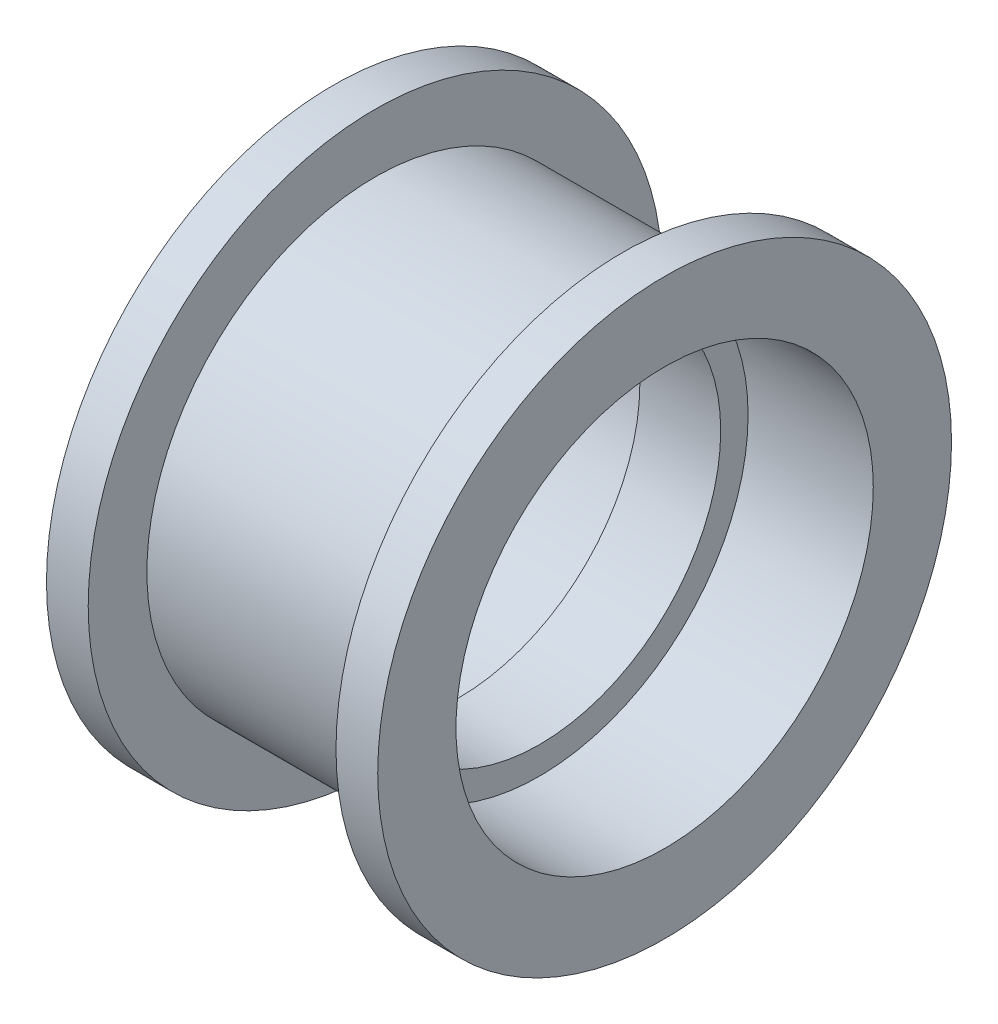
ISO-10303-21;
HEADER;
FILE_DESCRIPTION(('STEP AP214'),'2;1');
FILE_NAME('part.step','',(''),(''),'','','');
FILE_SCHEMA(('AUTOMOTIVE_DESIGN { 1 0 10303 214 1 1 1 1 }'));
ENDSEC;
DATA;
#1=APPLICATION_CONTEXT('core data for automotive mechanical design processes');
#2=APPLICATION_PROTOCOL_DEFINITION('international standard','automotive_design',2000,#1);
#3=PRODUCT_CONTEXT('',#1,'mechanical');
#4=PRODUCT('Part','Part','',(#3));
#5=PRODUCT_RELATED_PRODUCT_CATEGORY('part','',(#4));
#6=PRODUCT_DEFINITION_FORMATION('','',#4);
#7=PRODUCT_DEFINITION_CONTEXT('part definition',#1,'design');
#8=PRODUCT_DEFINITION('design','',#6,#7);
#9=PRODUCT_DEFINITION_SHAPE('','',#8);
#10=(LENGTH_UNIT() NAMED_UNIT(*) SI_UNIT(.MILLI.,.METRE.));
#11=(NAMED_UNIT(*) PLANE_ANGLE_UNIT() SI_UNIT($,.RADIAN.));
#12=(NAMED_UNIT(*) SI_UNIT($,.STERADIAN.) SOLID_ANGLE_UNIT());
#13=UNCERTAINTY_MEASURE_WITH_UNIT(LENGTH_MEASURE(1.E-05),#10,'distance_accuracy_value','');
#14=(GEOMETRIC_REPRESENTATION_CONTEXT(3) GLOBAL_UNCERTAINTY_ASSIGNED_CONTEXT((#13)) GLOBAL_UNIT_ASSIGNED_CONTEXT((#10,
#11,#12)) REPRESENTATION_CONTEXT('',''));
#15=CARTESIAN_POINT('',(0.,0.,0.));
#16=DIRECTION('',(0.,0.,1.));
#17=DIRECTION('',(1.,0.,0.));
#18=AXIS2_PLACEMENT_3D('',#15,#16,#17);
#19=CARTESIAN_POINT('',(-6.35,0.,0.));
#20=DIRECTION('',(1.,0.,0.));
#21=DIRECTION('',(0.,0.,-1.));
#22=AXIS2_PLACEMENT_3D('',#19,#20,#21);
#23=CYLINDRICAL_SURFACE('',#22,8.);
#24=CARTESIAN_POINT('',(-1.55,0.,0.));
#25=DIRECTION('',(1.,0.,0.));
#26=DIRECTION('',(0.,0.,-1.));
#27=AXIS2_PLACEMENT_3D('',#24,#25,#26);
#28=CIRCLE('',#27,8.);
#29=CARTESIAN_POINT('',(-1.55,0.,-8.));
#30=VERTEX_POINT('',#29);
#31=EDGE_CURVE('E140',#30,#30,#28,.T.);
#32=ORIENTED_EDGE('',*,*,#31,.T.);
#33=EDGE_LOOP('',(#32));
#34=FACE_BOUND('',#33,.T.);
#35=CARTESIAN_POINT('',(-6.35,0.,0.));
#36=DIRECTION('',(1.,0.,0.));
#37=DIRECTION('',(0.,0.,-1.));
#38=AXIS2_PLACEMENT_3D('',#35,#36,#37);
#39=CIRCLE('',#38,8.);
#40=CARTESIAN_POINT('',(-6.35,0.,-8.));
#41=VERTEX_POINT('',#40);
#42=EDGE_CURVE('E11',#41,#41,#39,.T.);
#43=ORIENTED_EDGE('',*,*,#42,.F.);
#44=EDGE_LOOP('',(#43));
#45=FACE_BOUND('',#44,.T.);
#46=ADVANCED_FACE('F39',(#34,#45),#23,.F.);
#47=CARTESIAN_POINT('',(-6.35,11.,0.));
#48=DIRECTION('',(-1.,0.,0.));
#49=DIRECTION('',(0.,0.,1.));
#50=AXIS2_PLACEMENT_3D('',#47,#48,#49);
#51=PLANE('',#50);
#52=ORIENTED_EDGE('',*,*,#42,.T.);
#53=EDGE_LOOP('',(#52));
#54=FACE_BOUND('',#53,.T.);
#55=CARTESIAN_POINT('',(-6.35,0.,0.));
#56=DIRECTION('',(1.,0.,0.));
#57=DIRECTION('',(0.,0.,-1.));
#58=AXIS2_PLACEMENT_3D('',#55,#56,#57);
#59=CIRCLE('',#58,11.);
#60=CARTESIAN_POINT('',(-6.35,0.,-11.));
#61=VERTEX_POINT('',#60);
#62=EDGE_CURVE('E48',#61,#61,#59,.T.);
#63=ORIENTED_EDGE('',*,*,#62,.F.);
#64=EDGE_LOOP('',(#63));
#65=FACE_BOUND('',#64,.T.);
#66=ADVANCED_FACE('F131',(#54,#65),#51,.T.);
#67=CARTESIAN_POINT('',(-6.35,0.,0.));
#68=DIRECTION('',(1.,0.,0.));
#69=DIRECTION('',(0.,0.,-1.));
#70=AXIS2_PLACEMENT_3D('',#67,#68,#69);
#71=CYLINDRICAL_SURFACE('',#70,11.);
#72=ORIENTED_EDGE('',*,*,#62,.T.);
#73=EDGE_LOOP('',(#72));
#74=FACE_BOUND('',#73,.T.);
#75=CARTESIAN_POINT('',(-4.75,0.,0.));
#76=DIRECTION('',(1.,0.,0.));
#77=DIRECTION('',(0.,0.,-1.));
#78=AXIS2_PLACEMENT_3D('',#75,#76,#77);
#79=CIRCLE('',#78,11.);
#80=CARTESIAN_POINT('',(-4.75,0.,-11.));
#81=VERTEX_POINT('',#80);
#82=EDGE_CURVE('E55',#81,#81,#79,.T.);
#83=ORIENTED_EDGE('',*,*,#82,.F.);
#84=EDGE_LOOP('',(#83));
#85=FACE_BOUND('',#84,.T.);
#86=ADVANCED_FACE('F136',(#74,#85),#71,.T.);
#87=CARTESIAN_POINT('',(-4.75,8.75,0.));
#88=DIRECTION('',(1.,0.,0.));
#89=DIRECTION('',(0.,0.,-1.));
#90=AXIS2_PLACEMENT_3D('',#87,#88,#89);
#91=PLANE('',#90);
#92=ORIENTED_EDGE('',*,*,#82,.T.);
#93=EDGE_LOOP('',(#92));
#94=FACE_BOUND('',#93,.T.);
#95=CARTESIAN_POINT('',(-4.75,0.,0.));
#96=DIRECTION('',(1.,0.,0.));
#97=DIRECTION('',(0.,0.,-1.));
#98=AXIS2_PLACEMENT_3D('',#95,#96,#97);
#99=CIRCLE('',#98,8.75);
#100=CARTESIAN_POINT('',(-4.75,0.,-8.75));
#101=VERTEX_POINT('',#100);
#102=EDGE_CURVE('E61',#101,#101,#99,.T.);
#103=ORIENTED_EDGE('',*,*,#102,.F.);
#104=EDGE_LOOP('',(#103));
#105=FACE_BOUND('',#104,.T.);
#106=ADVANCED_FACE('F126',(#94,#105),#91,.T.);
#107=CARTESIAN_POINT('',(-6.35,0.,0.));
#108=DIRECTION('',(1.,0.,0.));
#109=DIRECTION('',(0.,0.,-1.));
#110=AXIS2_PLACEMENT_3D('',#107,#108,#109);
#111=CYLINDRICAL_SURFACE('',#110,8.75);
#112=ORIENTED_EDGE('',*,*,#102,.T.);
#113=EDGE_LOOP('',(#112));
#114=FACE_BOUND('',#113,.T.);
#115=CARTESIAN_POINT('',(4.75,0.,0.));
#116=DIRECTION('',(1.,0.,0.));
#117=DIRECTION('',(0.,0.,-1.));
#118=AXIS2_PLACEMENT_3D('',#115,#116,#117);
#119=CIRCLE('',#118,8.75);
#120=CARTESIAN_POINT('',(4.75,0.,-8.75));
#121=VERTEX_POINT('',#120);
#122=EDGE_CURVE('E75',#121,#121,#119,.T.);
#123=ORIENTED_EDGE('',*,*,#122,.F.);
#124=EDGE_LOOP('',(#123));
#125=FACE_BOUND('',#124,.T.);
#126=ADVANCED_FACE('F117',(#114,#125),#111,.T.);
#127=CARTESIAN_POINT('',(4.75,11.,0.));
#128=DIRECTION('',(-1.,0.,0.));
#129=DIRECTION('',(0.,0.,1.));
#130=AXIS2_PLACEMENT_3D('',#127,#128,#129);
#131=PLANE('',#130);
#132=ORIENTED_EDGE('',*,*,#122,.T.);
#133=EDGE_LOOP('',(#132));
#134=FACE_BOUND('',#133,.T.);
#135=CARTESIAN_POINT('',(4.75,0.,0.));
#136=DIRECTION('',(1.,0.,0.));
#137=DIRECTION('',(0.,0.,-1.));
#138=AXIS2_PLACEMENT_3D('',#135,#136,#137);
#139=CIRCLE('',#138,11.);
#140=CARTESIAN_POINT('',(4.75,0.,-11.));
#141=VERTEX_POINT('',#140);
#142=EDGE_CURVE('E79',#141,#141,#139,.T.);
#143=ORIENTED_EDGE('',*,*,#142,.F.);
#144=EDGE_LOOP('',(#143));
#145=FACE_BOUND('',#144,.T.);
#146=ADVANCED_FACE('F115',(#134,#145),#131,.T.);
#147=CARTESIAN_POINT('',(-6.35,0.,0.));
#148=DIRECTION('',(1.,0.,0.));
#149=DIRECTION('',(0.,0.,-1.));
#150=AXIS2_PLACEMENT_3D('',#147,#148,#149);
#151=CYLINDRICAL_SURFACE('',#150,11.);
#152=ORIENTED_EDGE('',*,*,#142,.T.);
#153=EDGE_LOOP('',(#152));
#154=FACE_BOUND('',#153,.T.);
#155=CARTESIAN_POINT('',(6.35,0.,0.));
#156=DIRECTION('',(1.,0.,0.));
#157=DIRECTION('',(0.,0.,-1.));
#158=AXIS2_PLACEMENT_3D('',#155,#156,#157);
#159=CIRCLE('',#158,11.);
#160=CARTESIAN_POINT('',(6.35,0.,-11.));
#161=VERTEX_POINT('',#160);
#162=EDGE_CURVE('E102',#161,#161,#159,.T.);
#163=ORIENTED_EDGE('',*,*,#162,.F.);
#164=EDGE_LOOP('',(#163));
#165=FACE_BOUND('',#164,.T.);
#166=ADVANCED_FACE('F112',(#154,#165),#151,.T.);
#167=CARTESIAN_POINT('',(6.35,8.,0.));
#168=DIRECTION('',(1.,0.,0.));
#169=DIRECTION('',(0.,0.,-1.));
#170=AXIS2_PLACEMENT_3D('',#167,#168,#169);
#171=PLANE('',#170);
#172=ORIENTED_EDGE('',*,*,#162,.T.);
#173=EDGE_LOOP('',(#172));
#174=FACE_BOUND('',#173,.T.);
#175=CARTESIAN_POINT('',(6.35,0.,0.));
#176=DIRECTION('',(1.,0.,0.));
#177=DIRECTION('',(0.,0.,-1.));
#178=AXIS2_PLACEMENT_3D('',#175,#176,#177);
#179=CIRCLE('',#178,8.);
#180=CARTESIAN_POINT('',(6.35,0.,-8.));
#181=VERTEX_POINT('',#180);
#182=EDGE_CURVE('E95',#181,#181,#179,.T.);
#183=ORIENTED_EDGE('',*,*,#182,.F.);
#184=EDGE_LOOP('',(#183));
#185=FACE_BOUND('',#184,.T.);
#186=ADVANCED_FACE('F124',(#174,#185),#171,.T.);
#187=CARTESIAN_POINT('',(-6.35,0.,0.));
#188=DIRECTION('',(1.,0.,0.));
#189=DIRECTION('',(0.,0.,-1.));
#190=AXIS2_PLACEMENT_3D('',#187,#188,#189);
#191=CYLINDRICAL_SURFACE('',#190,8.);
#192=ORIENTED_EDGE('',*,*,#182,.T.);
#193=EDGE_LOOP('',(#192));
#194=FACE_BOUND('',#193,.T.);
#195=CARTESIAN_POINT('',(1.55,0.,0.));
#196=DIRECTION('',(1.,0.,0.));
#197=DIRECTION('',(0.,0.,-1.));
#198=AXIS2_PLACEMENT_3D('',#195,#196,#197);
#199=CIRCLE('',#198,8.);
#200=CARTESIAN_POINT('',(1.55,0.,-8.));
#201=VERTEX_POINT('',#200);
#202=EDGE_CURVE('E91',#201,#201,#199,.T.);
#203=ORIENTED_EDGE('',*,*,#202,.F.);
#204=EDGE_LOOP('',(#203));
#205=FACE_BOUND('',#204,.T.);
#206=ADVANCED_FACE('F156',(#194,#205),#191,.F.);
#207=CARTESIAN_POINT('',(1.55,6.95,0.));
#208=DIRECTION('',(1.,0.,0.));
#209=DIRECTION('',(0.,0.,-1.));
#210=AXIS2_PLACEMENT_3D('',#207,#208,#209);
#211=PLANE('',#210);
#212=ORIENTED_EDGE('',*,*,#202,.T.);
#213=EDGE_LOOP('',(#212));
#214=FACE_BOUND('',#213,.T.);
#215=CARTESIAN_POINT('',(1.55,0.,0.));
#216=DIRECTION('',(1.,0.,0.));
#217=DIRECTION('',(0.,0.,-1.));
#218=AXIS2_PLACEMENT_3D('',#215,#216,#217);
#219=CIRCLE('',#218,6.95);
#220=CARTESIAN_POINT('',(1.55,0.,-6.95));
#221=VERTEX_POINT('',#220);
#222=EDGE_CURVE('E96',#221,#221,#219,.T.);
#223=ORIENTED_EDGE('',*,*,#222,.F.);
#224=EDGE_LOOP('',(#223));
#225=FACE_BOUND('',#224,.T.);
#226=ADVANCED_FACE('F154',(#214,#225),#211,.T.);
#227=CARTESIAN_POINT('',(-6.35,0.,0.));
#228=DIRECTION('',(1.,0.,0.));
#229=DIRECTION('',(0.,0.,-1.));
#230=AXIS2_PLACEMENT_3D('',#227,#228,#229);
#231=CYLINDRICAL_SURFACE('',#230,6.95);
#232=ORIENTED_EDGE('',*,*,#222,.T.);
#233=EDGE_LOOP('',(#232));
#234=FACE_BOUND('',#233,.T.);
#235=CARTESIAN_POINT('',(-1.55,0.,0.));
#236=DIRECTION('',(1.,0.,0.));
#237=DIRECTION('',(0.,0.,-1.));
#238=AXIS2_PLACEMENT_3D('',#235,#236,#237);
#239=CIRCLE('',#238,6.95);
#240=CARTESIAN_POINT('',(-1.55,0.,-6.95));
#241=VERTEX_POINT('',#240);
#242=EDGE_CURVE('E142',#241,#241,#239,.T.);
#243=ORIENTED_EDGE('',*,*,#242,.F.);
#244=EDGE_LOOP('',(#243));
#245=FACE_BOUND('',#244,.T.);
#246=ADVANCED_FACE('F151',(#234,#245),#231,.F.);
#247=CARTESIAN_POINT('',(-1.55,8.,0.));
#248=DIRECTION('',(-1.,0.,0.));
#249=DIRECTION('',(0.,0.,1.));
#250=AXIS2_PLACEMENT_3D('',#247,#248,#249);
#251=PLANE('',#250);
#252=ORIENTED_EDGE('',*,*,#242,.T.);
#253=EDGE_LOOP('',(#252));
#254=FACE_BOUND('',#253,.T.);
#255=ORIENTED_EDGE('',*,*,#31,.F.);
#256=EDGE_LOOP('',(#255));
#257=FACE_BOUND('',#256,.T.);
#258=ADVANCED_FACE('F163',(#254,#257),#251,.T.);
#259=CLOSED_SHELL('',(#46,#66,#86,#106,#126,#146,#166,#186,#206,#226,#246,#258));
#260=MANIFOLD_SOLID_BREP('B2',#259);
#261=ADVANCED_BREP_SHAPE_REPRESENTATION('',(#18,#260),#14);
#262=SHAPE_DEFINITION_REPRESENTATION(#9,#261);
ENDSEC;
END-ISO-10303-21;
